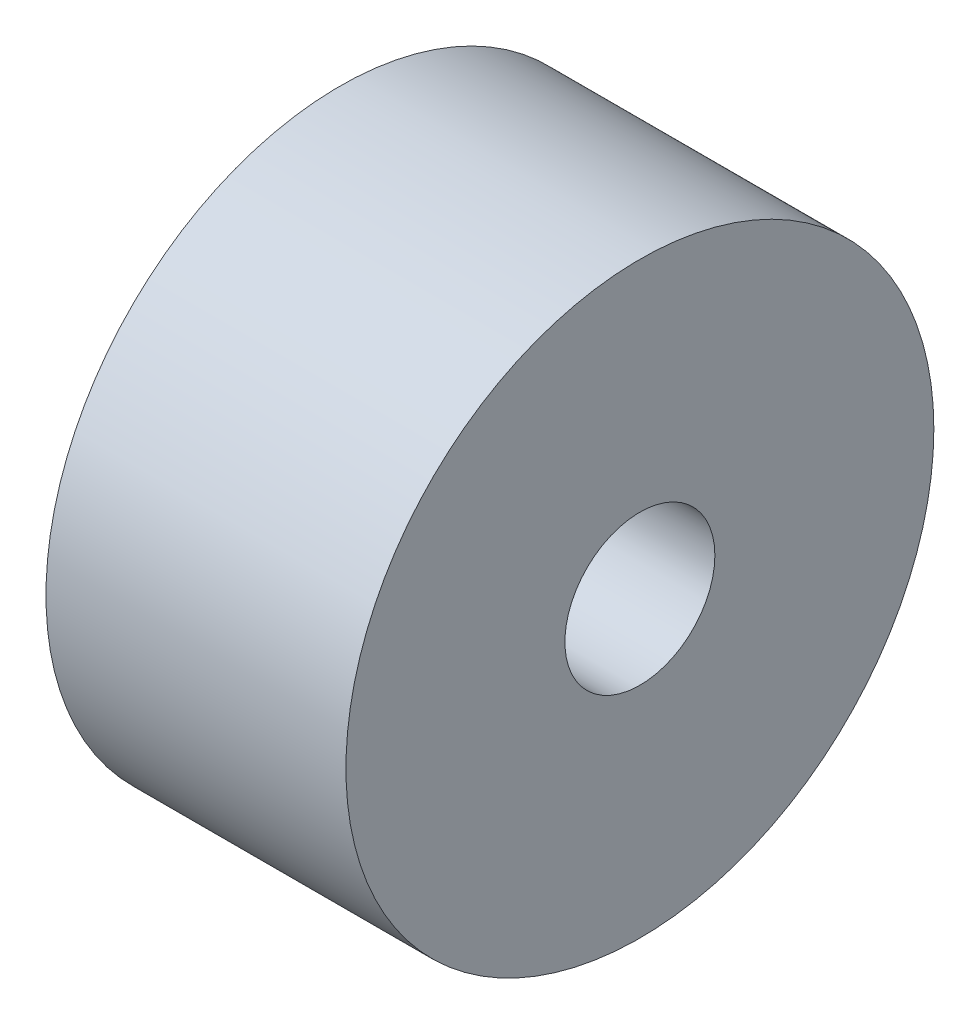
ISO-10303-21;
HEADER;
FILE_DESCRIPTION(('STEP AP214'),'2;1');
FILE_NAME('part.step','',(''),(''),'','','');
FILE_SCHEMA(('AUTOMOTIVE_DESIGN { 1 0 10303 214 1 1 1 1 }'));
ENDSEC;
DATA;
#1=APPLICATION_CONTEXT('core data for automotive mechanical design processes');
#2=APPLICATION_PROTOCOL_DEFINITION('international standard','automotive_design',2000,#1);
#3=PRODUCT_CONTEXT('',#1,'mechanical');
#4=PRODUCT('Part','Part','',(#3));
#5=PRODUCT_RELATED_PRODUCT_CATEGORY('part','',(#4));
#6=PRODUCT_DEFINITION_FORMATION('','',#4);
#7=PRODUCT_DEFINITION_CONTEXT('part definition',#1,'design');
#8=PRODUCT_DEFINITION('design','',#6,#7);
#9=PRODUCT_DEFINITION_SHAPE('','',#8);
#10=(LENGTH_UNIT() NAMED_UNIT(*) SI_UNIT(.MILLI.,.METRE.));
#11=(NAMED_UNIT(*) PLANE_ANGLE_UNIT() SI_UNIT($,.RADIAN.));
#12=(NAMED_UNIT(*) SI_UNIT($,.STERADIAN.) SOLID_ANGLE_UNIT());
#13=UNCERTAINTY_MEASURE_WITH_UNIT(LENGTH_MEASURE(1.E-05),#10,'distance_accuracy_value','');
#14=(GEOMETRIC_REPRESENTATION_CONTEXT(3) GLOBAL_UNCERTAINTY_ASSIGNED_CONTEXT((#13)) GLOBAL_UNIT_ASSIGNED_CONTEXT((#10,
#11,#12)) REPRESENTATION_CONTEXT('',''));
#15=CARTESIAN_POINT('',(0.,0.,0.));
#16=DIRECTION('',(0.,0.,1.));
#17=DIRECTION('',(1.,0.,0.));
#18=AXIS2_PLACEMENT_3D('',#15,#16,#17);
#19=CARTESIAN_POINT('',(50.,0.,0.));
#20=DIRECTION('',(1.,0.,0.));
#21=DIRECTION('',(0.,0.,-1.));
#22=AXIS2_PLACEMENT_3D('',#19,#20,#21);
#23=PLANE('',#22);
#24=CARTESIAN_POINT('',(50.,0.,0.));
#25=DIRECTION('',(1.,0.,0.));
#26=DIRECTION('',(0.,0.,-1.));
#27=AXIS2_PLACEMENT_3D('',#24,#25,#26);
#28=CIRCLE('',#27,49.);
#29=CARTESIAN_POINT('',(50.,0.,-49.));
#30=VERTEX_POINT('',#29);
#31=EDGE_CURVE('E10',#30,#30,#28,.T.);
#32=ORIENTED_EDGE('',*,*,#31,.T.);
#33=EDGE_LOOP('',(#32));
#34=FACE_BOUND('',#33,.T.);
#35=CARTESIAN_POINT('',(50.,0.,0.));
#36=DIRECTION('',(1.,0.,0.));
#37=DIRECTION('',(0.,0.,-1.));
#38=AXIS2_PLACEMENT_3D('',#35,#36,#37);
#39=CIRCLE('',#38,12.5);
#40=CARTESIAN_POINT('',(50.,0.,-12.5));
#41=VERTEX_POINT('',#40);
#42=EDGE_CURVE('E45',#41,#41,#39,.T.);
#43=ORIENTED_EDGE('',*,*,#42,.F.);
#44=EDGE_LOOP('',(#43));
#45=FACE_BOUND('',#44,.T.);
#46=ADVANCED_FACE('F34',(#34,#45),#23,.T.);
#47=CARTESIAN_POINT('',(0.,0.,0.));
#48=DIRECTION('',(1.,0.,0.));
#49=DIRECTION('',(0.,0.,-1.));
#50=AXIS2_PLACEMENT_3D('',#47,#48,#49);
#51=PLANE('',#50);
#52=CARTESIAN_POINT('',(0.,0.,0.));
#53=DIRECTION('',(1.,0.,0.));
#54=DIRECTION('',(0.,0.,-1.));
#55=AXIS2_PLACEMENT_3D('',#52,#53,#54);
#56=CIRCLE('',#55,49.);
#57=CARTESIAN_POINT('',(0.,0.,-49.));
#58=VERTEX_POINT('',#57);
#59=EDGE_CURVE('E38',#58,#58,#56,.T.);
#60=ORIENTED_EDGE('',*,*,#59,.F.);
#61=EDGE_LOOP('',(#60));
#62=FACE_BOUND('',#61,.T.);
#63=CARTESIAN_POINT('',(0.,0.,0.));
#64=DIRECTION('',(1.,0.,0.));
#65=DIRECTION('',(0.,0.,-1.));
#66=AXIS2_PLACEMENT_3D('',#63,#64,#65);
#67=CIRCLE('',#66,12.5);
#68=CARTESIAN_POINT('',(0.,0.,-12.5));
#69=VERTEX_POINT('',#68);
#70=EDGE_CURVE('E47',#69,#69,#67,.T.);
#71=ORIENTED_EDGE('',*,*,#70,.T.);
#72=EDGE_LOOP('',(#71));
#73=FACE_BOUND('',#72,.T.);
#74=ADVANCED_FACE('F57',(#62,#73),#51,.F.);
#75=CARTESIAN_POINT('',(50.,0.,0.));
#76=DIRECTION('',(-1.,0.,0.));
#77=DIRECTION('',(0.,0.,1.));
#78=AXIS2_PLACEMENT_3D('',#75,#76,#77);
#79=CYLINDRICAL_SURFACE('',#78,49.);
#80=ORIENTED_EDGE('',*,*,#31,.F.);
#81=EDGE_LOOP('',(#80));
#82=FACE_BOUND('',#81,.T.);
#83=ORIENTED_EDGE('',*,*,#59,.T.);
#84=EDGE_LOOP('',(#83));
#85=FACE_BOUND('',#84,.T.);
#86=ADVANCED_FACE('F36',(#82,#85),#79,.T.);
#87=CARTESIAN_POINT('',(50.,0.,0.));
#88=DIRECTION('',(-1.,0.,0.));
#89=DIRECTION('',(0.,0.,1.));
#90=AXIS2_PLACEMENT_3D('',#87,#88,#89);
#91=CYLINDRICAL_SURFACE('',#90,12.5);
#92=ORIENTED_EDGE('',*,*,#42,.T.);
#93=EDGE_LOOP('',(#92));
#94=FACE_BOUND('',#93,.T.);
#95=ORIENTED_EDGE('',*,*,#70,.F.);
#96=EDGE_LOOP('',(#95));
#97=FACE_BOUND('',#96,.T.);
#98=ADVANCED_FACE('F53',(#94,#97),#91,.F.);
#99=CLOSED_SHELL('',(#46,#74,#86,#98));
#100=MANIFOLD_SOLID_BREP('B2',#99);
#101=ADVANCED_BREP_SHAPE_REPRESENTATION('',(#18,#100),#14);
#102=SHAPE_DEFINITION_REPRESENTATION(#9,#101);
ENDSEC;
END-ISO-10303-21;
